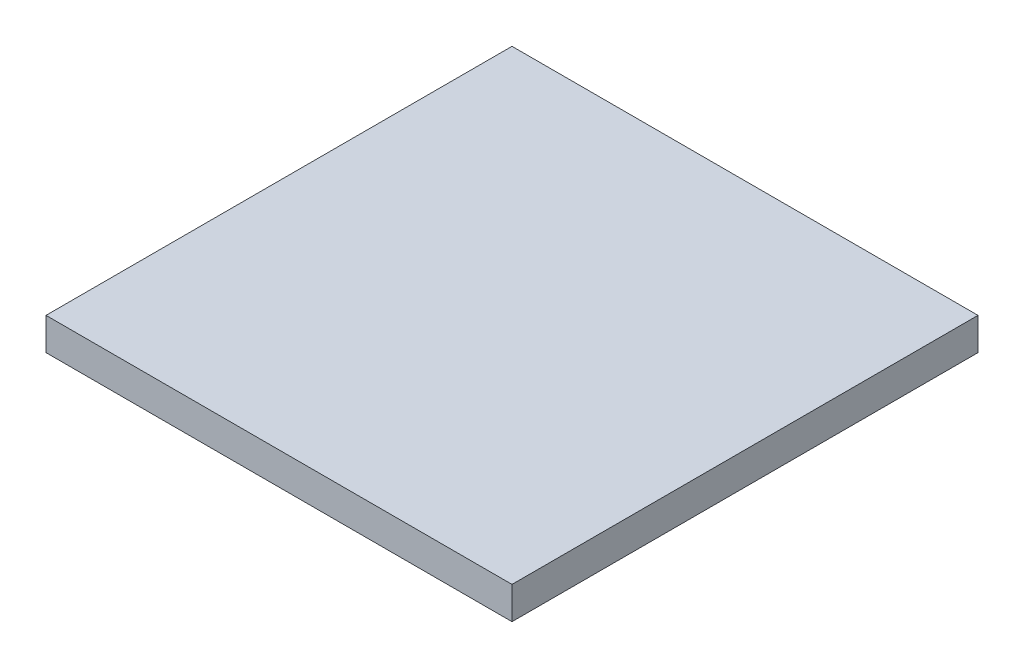
ISO-10303-21;
HEADER;
FILE_DESCRIPTION(('STEP AP214'),'2;1');
FILE_NAME('part.step','',(''),(''),'','','');
FILE_SCHEMA(('AUTOMOTIVE_DESIGN { 1 0 10303 214 1 1 1 1 }'));
ENDSEC;
DATA;
#1=APPLICATION_CONTEXT('core data for automotive mechanical design processes');
#2=APPLICATION_PROTOCOL_DEFINITION('international standard','automotive_design',2000,#1);
#3=PRODUCT_CONTEXT('',#1,'mechanical');
#4=PRODUCT('Part','Part','',(#3));
#5=PRODUCT_RELATED_PRODUCT_CATEGORY('part','',(#4));
#6=PRODUCT_DEFINITION_FORMATION('','',#4);
#7=PRODUCT_DEFINITION_CONTEXT('part definition',#1,'design');
#8=PRODUCT_DEFINITION('design','',#6,#7);
#9=PRODUCT_DEFINITION_SHAPE('','',#8);
#10=(LENGTH_UNIT() NAMED_UNIT(*) SI_UNIT(.MILLI.,.METRE.));
#11=(NAMED_UNIT(*) PLANE_ANGLE_UNIT() SI_UNIT($,.RADIAN.));
#12=(NAMED_UNIT(*) SI_UNIT($,.STERADIAN.) SOLID_ANGLE_UNIT());
#13=UNCERTAINTY_MEASURE_WITH_UNIT(LENGTH_MEASURE(1.E-05),#10,'distance_accuracy_value','');
#14=(GEOMETRIC_REPRESENTATION_CONTEXT(3) GLOBAL_UNCERTAINTY_ASSIGNED_CONTEXT((#13)) GLOBAL_UNIT_ASSIGNED_CONTEXT((#10,
#11,#12)) REPRESENTATION_CONTEXT('',''));
#15=CARTESIAN_POINT('',(0.,0.,0.));
#16=DIRECTION('',(0.,0.,1.));
#17=DIRECTION('',(1.,0.,0.));
#18=AXIS2_PLACEMENT_3D('',#15,#16,#17);
#19=CARTESIAN_POINT('',(15.,2.08,15.));
#20=DIRECTION('',(-1.,0.,0.));
#21=DIRECTION('',(0.,0.,1.));
#22=AXIS2_PLACEMENT_3D('',#19,#20,#21);
#23=PLANE('',#22);
#24=DIRECTION('',(0.,0.,-1.));
#25=VECTOR('',#24,1.);
#26=CARTESIAN_POINT('',(15.,0.,15.));
#27=LINE('',#26,#25);
#28=CARTESIAN_POINT('',(15.,0.,15.));
#29=VERTEX_POINT('',#28);
#30=CARTESIAN_POINT('',(15.,0.,-15.));
#31=VERTEX_POINT('',#30);
#32=EDGE_CURVE('E104',#29,#31,#27,.T.);
#33=ORIENTED_EDGE('',*,*,#32,.T.);
#34=DIRECTION('',(0.,-1.,0.));
#35=VECTOR('',#34,1.);
#36=CARTESIAN_POINT('',(15.,2.08,-15.));
#37=LINE('',#36,#35);
#38=CARTESIAN_POINT('',(15.,2.08,-15.));
#39=VERTEX_POINT('',#38);
#40=EDGE_CURVE('E11',#39,#31,#37,.T.);
#41=ORIENTED_EDGE('',*,*,#40,.F.);
#42=DIRECTION('',(0.,0.,-1.));
#43=VECTOR('',#42,1.);
#44=CARTESIAN_POINT('',(15.,2.08,15.));
#45=LINE('',#44,#43);
#46=CARTESIAN_POINT('',(15.,2.08,15.));
#47=VERTEX_POINT('',#46);
#48=EDGE_CURVE('E92',#47,#39,#45,.T.);
#49=ORIENTED_EDGE('',*,*,#48,.F.);
#50=DIRECTION('',(0.,-1.,0.));
#51=VECTOR('',#50,1.);
#52=CARTESIAN_POINT('',(15.,2.08,15.));
#53=LINE('',#52,#51);
#54=EDGE_CURVE('E100',#47,#29,#53,.T.);
#55=ORIENTED_EDGE('',*,*,#54,.T.);
#56=EDGE_LOOP('',(#33,#41,#49,#55));
#57=FACE_BOUND('',#56,.T.);
#58=ADVANCED_FACE('F41',(#57),#23,.F.);
#59=CARTESIAN_POINT('',(-15.,2.08,-15.));
#60=DIRECTION('',(0.,0.,1.));
#61=DIRECTION('',(1.,0.,0.));
#62=AXIS2_PLACEMENT_3D('',#59,#60,#61);
#63=PLANE('',#62);
#64=DIRECTION('',(-1.,0.,0.));
#65=VECTOR('',#64,1.);
#66=CARTESIAN_POINT('',(-15.,0.,-15.));
#67=LINE('',#66,#65);
#68=CARTESIAN_POINT('',(-15.,0.,-15.));
#69=VERTEX_POINT('',#68);
#70=EDGE_CURVE('E96',#31,#69,#67,.T.);
#71=ORIENTED_EDGE('',*,*,#70,.T.);
#72=DIRECTION('',(0.,-1.,0.));
#73=VECTOR('',#72,1.);
#74=CARTESIAN_POINT('',(-15.,2.08,-15.));
#75=LINE('',#74,#73);
#76=CARTESIAN_POINT('',(-15.,2.08,-15.));
#77=VERTEX_POINT('',#76);
#78=EDGE_CURVE('E49',#77,#69,#75,.T.);
#79=ORIENTED_EDGE('',*,*,#78,.F.);
#80=DIRECTION('',(-1.,0.,0.));
#81=VECTOR('',#80,1.);
#82=CARTESIAN_POINT('',(-15.,2.08,-15.));
#83=LINE('',#82,#81);
#84=EDGE_CURVE('E87',#39,#77,#83,.T.);
#85=ORIENTED_EDGE('',*,*,#84,.F.);
#86=ORIENTED_EDGE('',*,*,#40,.T.);
#87=EDGE_LOOP('',(#71,#79,#85,#86));
#88=FACE_BOUND('',#87,.T.);
#89=ADVANCED_FACE('F95',(#88),#63,.F.);
#90=CARTESIAN_POINT('',(-15.,2.08,15.));
#91=DIRECTION('',(1.,0.,0.));
#92=DIRECTION('',(0.,0.,-1.));
#93=AXIS2_PLACEMENT_3D('',#90,#91,#92);
#94=PLANE('',#93);
#95=DIRECTION('',(0.,0.,1.));
#96=VECTOR('',#95,1.);
#97=CARTESIAN_POINT('',(-15.,0.,15.));
#98=LINE('',#97,#96);
#99=CARTESIAN_POINT('',(-15.,0.,15.));
#100=VERTEX_POINT('',#99);
#101=EDGE_CURVE('E74',#69,#100,#98,.T.);
#102=ORIENTED_EDGE('',*,*,#101,.T.);
#103=DIRECTION('',(0.,-1.,0.));
#104=VECTOR('',#103,1.);
#105=CARTESIAN_POINT('',(-15.,2.08,15.));
#106=LINE('',#105,#104);
#107=CARTESIAN_POINT('',(-15.,2.08,15.));
#108=VERTEX_POINT('',#107);
#109=EDGE_CURVE('E97',#108,#100,#106,.T.);
#110=ORIENTED_EDGE('',*,*,#109,.F.);
#111=DIRECTION('',(0.,0.,1.));
#112=VECTOR('',#111,1.);
#113=CARTESIAN_POINT('',(-15.,2.08,15.));
#114=LINE('',#113,#112);
#115=EDGE_CURVE('E90',#77,#108,#114,.T.);
#116=ORIENTED_EDGE('',*,*,#115,.F.);
#117=ORIENTED_EDGE('',*,*,#78,.T.);
#118=EDGE_LOOP('',(#102,#110,#116,#117));
#119=FACE_BOUND('',#118,.T.);
#120=ADVANCED_FACE('F98',(#119),#94,.F.);
#121=CARTESIAN_POINT('',(-15.,2.08,15.));
#122=DIRECTION('',(0.,0.,-1.));
#123=DIRECTION('',(-1.,0.,0.));
#124=AXIS2_PLACEMENT_3D('',#121,#122,#123);
#125=PLANE('',#124);
#126=DIRECTION('',(1.,0.,0.));
#127=VECTOR('',#126,1.);
#128=CARTESIAN_POINT('',(-15.,0.,15.));
#129=LINE('',#128,#127);
#130=EDGE_CURVE('E80',#100,#29,#129,.T.);
#131=ORIENTED_EDGE('',*,*,#130,.T.);
#132=ORIENTED_EDGE('',*,*,#54,.F.);
#133=DIRECTION('',(1.,0.,0.));
#134=VECTOR('',#133,1.);
#135=CARTESIAN_POINT('',(-15.,2.08,15.));
#136=LINE('',#135,#134);
#137=EDGE_CURVE('E57',#108,#47,#136,.T.);
#138=ORIENTED_EDGE('',*,*,#137,.F.);
#139=ORIENTED_EDGE('',*,*,#109,.T.);
#140=EDGE_LOOP('',(#131,#132,#138,#139));
#141=FACE_BOUND('',#140,.T.);
#142=ADVANCED_FACE('F111',(#141),#125,.F.);
#143=CARTESIAN_POINT('',(0.,2.08,0.));
#144=DIRECTION('',(0.,-1.,0.));
#145=DIRECTION('',(0.,0.,-1.));
#146=AXIS2_PLACEMENT_3D('',#143,#144,#145);
#147=PLANE('',#146);
#148=ORIENTED_EDGE('',*,*,#48,.T.);
#149=ORIENTED_EDGE('',*,*,#84,.T.);
#150=ORIENTED_EDGE('',*,*,#115,.T.);
#151=ORIENTED_EDGE('',*,*,#137,.T.);
#152=EDGE_LOOP('',(#148,#149,#150,#151));
#153=FACE_BOUND('',#152,.T.);
#154=ADVANCED_FACE('F88',(#153),#147,.F.);
#155=CARTESIAN_POINT('',(0.,0.,0.));
#156=DIRECTION('',(0.,-1.,0.));
#157=DIRECTION('',(0.,0.,-1.));
#158=AXIS2_PLACEMENT_3D('',#155,#156,#157);
#159=PLANE('',#158);
#160=ORIENTED_EDGE('',*,*,#32,.F.);
#161=ORIENTED_EDGE('',*,*,#130,.F.);
#162=ORIENTED_EDGE('',*,*,#101,.F.);
#163=ORIENTED_EDGE('',*,*,#70,.F.);
#164=EDGE_LOOP('',(#160,#161,#162,#163));
#165=FACE_BOUND('',#164,.T.);
#166=ADVANCED_FACE('F114',(#165),#159,.T.);
#167=CLOSED_SHELL('',(#58,#89,#120,#142,#154,#166));
#168=MANIFOLD_SOLID_BREP('B2',#167);
#169=ADVANCED_BREP_SHAPE_REPRESENTATION('',(#18,#168),#14);
#170=SHAPE_DEFINITION_REPRESENTATION(#9,#169);
ENDSEC;
END-ISO-10303-21;
